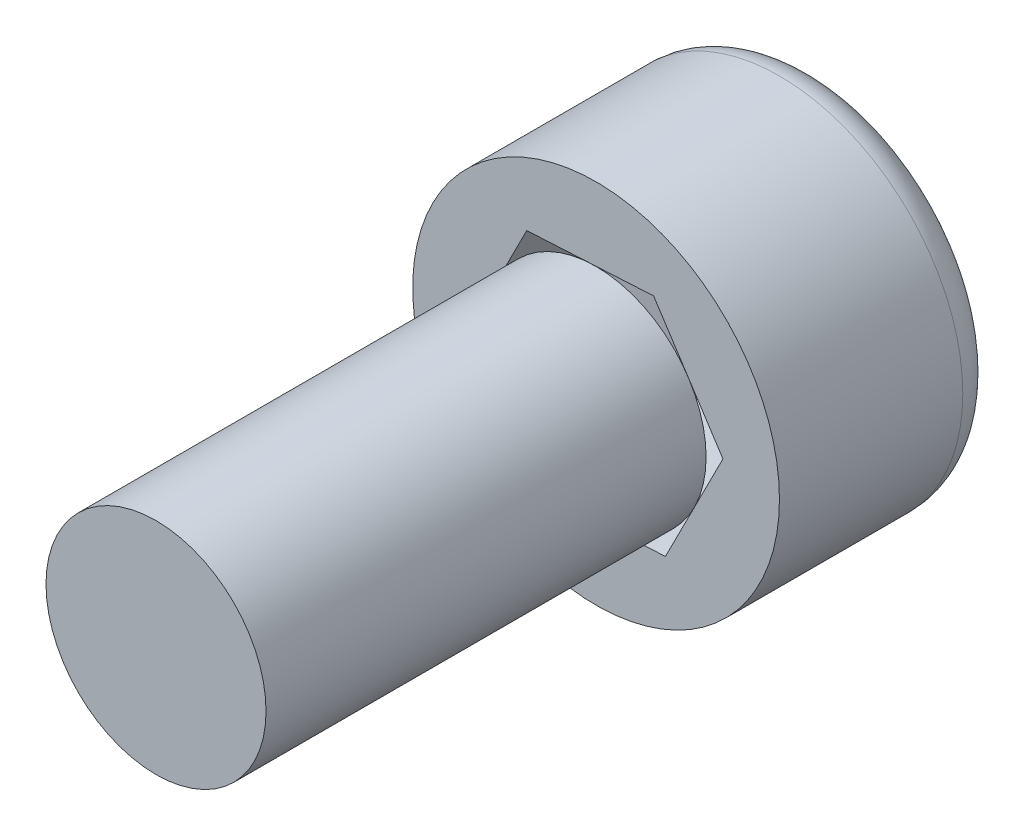
ISO-10303-21;
HEADER;
FILE_DESCRIPTION(('STEP AP214'),'2;1');
FILE_NAME('part.step','',(''),(''),'','','');
FILE_SCHEMA(('AUTOMOTIVE_DESIGN { 1 0 10303 214 1 1 1 1 }'));
ENDSEC;
DATA;
#1=APPLICATION_CONTEXT('core data for automotive mechanical design processes');
#2=APPLICATION_PROTOCOL_DEFINITION('international standard','automotive_design',2000,#1);
#3=PRODUCT_CONTEXT('',#1,'mechanical');
#4=PRODUCT('Part','Part','',(#3));
#5=PRODUCT_RELATED_PRODUCT_CATEGORY('part','',(#4));
#6=PRODUCT_DEFINITION_FORMATION('','',#4);
#7=PRODUCT_DEFINITION_CONTEXT('part definition',#1,'design');
#8=PRODUCT_DEFINITION('design','',#6,#7);
#9=PRODUCT_DEFINITION_SHAPE('','',#8);
#10=(LENGTH_UNIT() NAMED_UNIT(*) SI_UNIT(.MILLI.,.METRE.));
#11=(NAMED_UNIT(*) PLANE_ANGLE_UNIT() SI_UNIT($,.RADIAN.));
#12=(NAMED_UNIT(*) SI_UNIT($,.STERADIAN.) SOLID_ANGLE_UNIT());
#13=UNCERTAINTY_MEASURE_WITH_UNIT(LENGTH_MEASURE(1.E-05),#10,'distance_accuracy_value','');
#14=(GEOMETRIC_REPRESENTATION_CONTEXT(3) GLOBAL_UNCERTAINTY_ASSIGNED_CONTEXT((#13)) GLOBAL_UNIT_ASSIGNED_CONTEXT((#10,
#11,#12)) REPRESENTATION_CONTEXT('',''));
#15=CARTESIAN_POINT('',(0.,0.,0.));
#16=DIRECTION('',(0.,0.,1.));
#17=DIRECTION('',(1.,0.,0.));
#18=AXIS2_PLACEMENT_3D('',#15,#16,#17);
#19=CARTESIAN_POINT('',(0.,0.,3.));
#20=DIRECTION('',(0.,0.,-1.));
#21=DIRECTION('',(-1.,0.,0.));
#22=AXIS2_PLACEMENT_3D('',#19,#20,#21);
#23=CYLINDRICAL_SURFACE('',#22,2.5);
#24=CARTESIAN_POINT('',(0.,0.,0.5));
#25=DIRECTION('',(0.,0.,1.));
#26=DIRECTION('',(1.,0.,0.));
#27=AXIS2_PLACEMENT_3D('',#24,#25,#26);
#28=CIRCLE('',#27,2.5);
#29=CARTESIAN_POINT('',(2.5,0.,0.5));
#30=VERTEX_POINT('',#29);
#31=EDGE_CURVE('E49',#30,#30,#28,.T.);
#32=ORIENTED_EDGE('',*,*,#31,.T.);
#33=EDGE_LOOP('',(#32));
#34=FACE_BOUND('',#33,.T.);
#35=CARTESIAN_POINT('',(0.,0.,3.));
#36=DIRECTION('',(0.,0.,1.));
#37=DIRECTION('',(1.,0.,0.));
#38=AXIS2_PLACEMENT_3D('',#35,#36,#37);
#39=CIRCLE('',#38,2.5);
#40=CARTESIAN_POINT('',(2.5,0.,3.));
#41=VERTEX_POINT('',#40);
#42=EDGE_CURVE('E164',#41,#41,#39,.T.);
#43=ORIENTED_EDGE('',*,*,#42,.F.);
#44=EDGE_LOOP('',(#43));
#45=FACE_BOUND('',#44,.T.);
#46=ADVANCED_FACE('F40',(#34,#45),#23,.T.);
#47=CARTESIAN_POINT('',(0.,0.,3.));
#48=DIRECTION('',(0.,0.,1.));
#49=DIRECTION('',(1.,0.,0.));
#50=AXIS2_PLACEMENT_3D('',#47,#48,#49);
#51=PLANE('',#50);
#52=DIRECTION('',(-0.998565318577122,-0.0535472178079434,0.));
#53=VECTOR('',#52,1.);
#54=CARTESIAN_POINT('',(0.945103759937804,-1.45147472694203,3.));
#55=LINE('',#54,#53);
#56=CARTESIAN_POINT('',(0.945103759937804,-1.45147472694203,3.));
#57=VERTEX_POINT('',#56);
#58=CARTESIAN_POINT('',(-0.784462106513973,-1.54422122878934,3.));
#59=VERTEX_POINT('',#58);
#60=EDGE_CURVE('E93',#57,#59,#55,.T.);
#61=ORIENTED_EDGE('',*,*,#60,.T.);
#62=DIRECTION('',(-0.545655910212218,0.838009324321917,0.));
#63=VECTOR('',#62,1.);
#64=CARTESIAN_POINT('',(-0.784462106513973,-1.54422122878934,3.));
#65=LINE('',#64,#63);
#66=CARTESIAN_POINT('',(-1.72956586645178,-0.0927465018473138,3.));
#67=VERTEX_POINT('',#66);
#68=EDGE_CURVE('E56',#59,#67,#65,.T.);
#69=ORIENTED_EDGE('',*,*,#68,.T.);
#70=DIRECTION('',(0.452909408364904,0.89155654212986,0.));
#71=VECTOR('',#70,1.);
#72=CARTESIAN_POINT('',(-1.72956586645178,-0.0927465018473138,3.));
#73=LINE('',#72,#71);
#74=CARTESIAN_POINT('',(-0.945103759937803,1.45147472694203,3.));
#75=VERTEX_POINT('',#74);
#76=EDGE_CURVE('E103',#67,#75,#73,.T.);
#77=ORIENTED_EDGE('',*,*,#76,.T.);
#78=DIRECTION('',(0.998565318577122,0.0535472178079431,0.));
#79=VECTOR('',#78,1.);
#80=CARTESIAN_POINT('',(-0.945103759937803,1.45147472694203,3.));
#81=LINE('',#80,#79);
#82=CARTESIAN_POINT('',(0.784462106513974,1.54422122878934,3.));
#83=VERTEX_POINT('',#82);
#84=EDGE_CURVE('E175',#75,#83,#81,.T.);
#85=ORIENTED_EDGE('',*,*,#84,.T.);
#86=DIRECTION('',(0.545655910212218,-0.838009324321917,0.));
#87=VECTOR('',#86,1.);
#88=CARTESIAN_POINT('',(0.784462106513974,1.54422122878934,3.));
#89=LINE('',#88,#87);
#90=CARTESIAN_POINT('',(1.72956586645178,0.0927465018473145,3.));
#91=VERTEX_POINT('',#90);
#92=EDGE_CURVE('E173',#83,#91,#89,.T.);
#93=ORIENTED_EDGE('',*,*,#92,.T.);
#94=DIRECTION('',(-0.452909408364904,-0.89155654212986,0.));
#95=VECTOR('',#94,1.);
#96=CARTESIAN_POINT('',(1.72956586645178,0.0927465018473145,3.));
#97=LINE('',#96,#95);
#98=EDGE_CURVE('E108',#91,#57,#97,.T.);
#99=ORIENTED_EDGE('',*,*,#98,.T.);
#100=EDGE_LOOP('',(#61,#69,#77,#85,#93,#99));
#101=FACE_BOUND('',#100,.T.);
#102=ORIENTED_EDGE('',*,*,#42,.T.);
#103=EDGE_LOOP('',(#102));
#104=FACE_BOUND('',#103,.T.);
#105=ADVANCED_FACE('F105',(#101,#104),#51,.T.);
#106=CARTESIAN_POINT('',(0.,0.,0.));
#107=DIRECTION('',(0.,0.,1.));
#108=DIRECTION('',(1.,0.,0.));
#109=AXIS2_PLACEMENT_3D('',#106,#107,#108);
#110=PLANE('',#109);
#111=CARTESIAN_POINT('',(0.,0.,0.));
#112=DIRECTION('',(0.,0.,1.));
#113=DIRECTION('',(1.,0.,0.));
#114=AXIS2_PLACEMENT_3D('',#111,#112,#113);
#115=CIRCLE('',#114,2.);
#116=CARTESIAN_POINT('',(2.,0.,0.));
#117=VERTEX_POINT('',#116);
#118=EDGE_CURVE('E12',#117,#117,#115,.F.);
#119=ORIENTED_EDGE('',*,*,#118,.T.);
#120=EDGE_LOOP('',(#119));
#121=FACE_BOUND('',#120,.T.);
#122=DIRECTION('',(-0.545655910212218,0.838009324321917,0.));
#123=VECTOR('',#122,1.);
#124=CARTESIAN_POINT('',(-0.784462106513973,-1.54422122878934,0.));
#125=LINE('',#124,#123);
#126=CARTESIAN_POINT('',(-0.784462106513973,-1.54422122878934,0.));
#127=VERTEX_POINT('',#126);
#128=CARTESIAN_POINT('',(-1.72956586645178,-0.0927465018473138,0.));
#129=VERTEX_POINT('',#128);
#130=EDGE_CURVE('E98',#127,#129,#125,.T.);
#131=ORIENTED_EDGE('',*,*,#130,.F.);
#132=DIRECTION('',(-0.998565318577122,-0.0535472178079434,0.));
#133=VECTOR('',#132,1.);
#134=CARTESIAN_POINT('',(0.945103759937804,-1.45147472694203,0.));
#135=LINE('',#134,#133);
#136=CARTESIAN_POINT('',(0.945103759937804,-1.45147472694203,0.));
#137=VERTEX_POINT('',#136);
#138=EDGE_CURVE('E89',#137,#127,#135,.T.);
#139=ORIENTED_EDGE('',*,*,#138,.F.);
#140=DIRECTION('',(-0.452909408364904,-0.89155654212986,0.));
#141=VECTOR('',#140,1.);
#142=CARTESIAN_POINT('',(1.72956586645178,0.0927465018473145,0.));
#143=LINE('',#142,#141);
#144=CARTESIAN_POINT('',(1.72956586645178,0.0927465018473145,0.));
#145=VERTEX_POINT('',#144);
#146=EDGE_CURVE('E155',#145,#137,#143,.T.);
#147=ORIENTED_EDGE('',*,*,#146,.F.);
#148=DIRECTION('',(0.545655910212218,-0.838009324321917,0.));
#149=VECTOR('',#148,1.);
#150=CARTESIAN_POINT('',(0.784462106513974,1.54422122878934,0.));
#151=LINE('',#150,#149);
#152=CARTESIAN_POINT('',(0.784462106513974,1.54422122878934,0.));
#153=VERTEX_POINT('',#152);
#154=EDGE_CURVE('E188',#153,#145,#151,.T.);
#155=ORIENTED_EDGE('',*,*,#154,.F.);
#156=DIRECTION('',(0.998565318577122,0.0535472178079431,0.));
#157=VECTOR('',#156,1.);
#158=CARTESIAN_POINT('',(-0.945103759937803,1.45147472694203,0.));
#159=LINE('',#158,#157);
#160=CARTESIAN_POINT('',(-0.945103759937803,1.45147472694203,0.));
#161=VERTEX_POINT('',#160);
#162=EDGE_CURVE('E184',#161,#153,#159,.T.);
#163=ORIENTED_EDGE('',*,*,#162,.F.);
#164=DIRECTION('',(0.452909408364904,0.89155654212986,0.));
#165=VECTOR('',#164,1.);
#166=CARTESIAN_POINT('',(-1.72956586645178,-0.0927465018473138,0.));
#167=LINE('',#166,#165);
#168=EDGE_CURVE('E181',#129,#161,#167,.T.);
#169=ORIENTED_EDGE('',*,*,#168,.F.);
#170=EDGE_LOOP('',(#131,#139,#147,#155,#163,#169));
#171=FACE_BOUND('',#170,.T.);
#172=ADVANCED_FACE('F130',(#121,#171),#110,.F.);
#173=CARTESIAN_POINT('',(0.945103759937804,-1.45147472694203,3.));
#174=DIRECTION('',(0.0535472178079434,-0.998565318577122,0.));
#175=DIRECTION('',(0.998565318577122,0.0535472178079434,0.));
#176=AXIS2_PLACEMENT_3D('',#173,#174,#175);
#177=PLANE('',#176);
#178=ORIENTED_EDGE('',*,*,#138,.T.);
#179=DIRECTION('',(0.,0.,-1.));
#180=VECTOR('',#179,1.);
#181=CARTESIAN_POINT('',(-0.784462106513973,-1.54422122878934,3.));
#182=LINE('',#181,#180);
#183=EDGE_CURVE('E91',#59,#127,#182,.T.);
#184=ORIENTED_EDGE('',*,*,#183,.F.);
#185=ORIENTED_EDGE('',*,*,#60,.F.);
#186=DIRECTION('',(0.,0.,-1.));
#187=VECTOR('',#186,1.);
#188=CARTESIAN_POINT('',(0.945103759937804,-1.45147472694203,3.));
#189=LINE('',#188,#187);
#190=EDGE_CURVE('E156',#57,#137,#189,.T.);
#191=ORIENTED_EDGE('',*,*,#190,.T.);
#192=EDGE_LOOP('',(#178,#184,#185,#191));
#193=FACE_BOUND('',#192,.T.);
#194=ADVANCED_FACE('F92',(#193),#177,.F.);
#195=CARTESIAN_POINT('',(1.72956586645178,0.0927465018473145,3.));
#196=DIRECTION('',(0.89155654212986,-0.452909408364904,0.));
#197=DIRECTION('',(0.452909408364904,0.89155654212986,0.));
#198=AXIS2_PLACEMENT_3D('',#195,#196,#197);
#199=PLANE('',#198);
#200=ORIENTED_EDGE('',*,*,#146,.T.);
#201=ORIENTED_EDGE('',*,*,#190,.F.);
#202=ORIENTED_EDGE('',*,*,#98,.F.);
#203=DIRECTION('',(0.,0.,-1.));
#204=VECTOR('',#203,1.);
#205=CARTESIAN_POINT('',(1.72956586645178,0.0927465018473145,3.));
#206=LINE('',#205,#204);
#207=EDGE_CURVE('E158',#91,#145,#206,.T.);
#208=ORIENTED_EDGE('',*,*,#207,.T.);
#209=EDGE_LOOP('',(#200,#201,#202,#208));
#210=FACE_BOUND('',#209,.T.);
#211=ADVANCED_FACE('F137',(#210),#199,.F.);
#212=CARTESIAN_POINT('',(0.784462106513974,1.54422122878934,3.));
#213=DIRECTION('',(0.838009324321917,0.545655910212218,0.));
#214=DIRECTION('',(-0.545655910212218,0.838009324321917,0.));
#215=AXIS2_PLACEMENT_3D('',#212,#213,#214);
#216=PLANE('',#215);
#217=ORIENTED_EDGE('',*,*,#154,.T.);
#218=ORIENTED_EDGE('',*,*,#207,.F.);
#219=ORIENTED_EDGE('',*,*,#92,.F.);
#220=DIRECTION('',(0.,0.,-1.));
#221=VECTOR('',#220,1.);
#222=CARTESIAN_POINT('',(0.784462106513974,1.54422122878934,3.));
#223=LINE('',#222,#221);
#224=EDGE_CURVE('E186',#83,#153,#223,.T.);
#225=ORIENTED_EDGE('',*,*,#224,.T.);
#226=EDGE_LOOP('',(#217,#218,#219,#225));
#227=FACE_BOUND('',#226,.T.);
#228=ADVANCED_FACE('F145',(#227),#216,.F.);
#229=CARTESIAN_POINT('',(-0.945103759937803,1.45147472694203,3.));
#230=DIRECTION('',(-0.0535472178079431,0.998565318577122,0.));
#231=DIRECTION('',(-0.998565318577122,-0.0535472178079432,0.));
#232=AXIS2_PLACEMENT_3D('',#229,#230,#231);
#233=PLANE('',#232);
#234=ORIENTED_EDGE('',*,*,#162,.T.);
#235=ORIENTED_EDGE('',*,*,#224,.F.);
#236=ORIENTED_EDGE('',*,*,#84,.F.);
#237=DIRECTION('',(0.,0.,-1.));
#238=VECTOR('',#237,1.);
#239=CARTESIAN_POINT('',(-0.945103759937803,1.45147472694203,3.));
#240=LINE('',#239,#238);
#241=EDGE_CURVE('E180',#75,#161,#240,.T.);
#242=ORIENTED_EDGE('',*,*,#241,.T.);
#243=EDGE_LOOP('',(#234,#235,#236,#242));
#244=FACE_BOUND('',#243,.T.);
#245=ADVANCED_FACE('F141',(#244),#233,.F.);
#246=CARTESIAN_POINT('',(-1.72956586645178,-0.0927465018473138,3.));
#247=DIRECTION('',(-0.89155654212986,0.452909408364904,0.));
#248=DIRECTION('',(-0.452909408364904,-0.89155654212986,0.));
#249=AXIS2_PLACEMENT_3D('',#246,#247,#248);
#250=PLANE('',#249);
#251=ORIENTED_EDGE('',*,*,#168,.T.);
#252=ORIENTED_EDGE('',*,*,#241,.F.);
#253=ORIENTED_EDGE('',*,*,#76,.F.);
#254=DIRECTION('',(0.,0.,-1.));
#255=VECTOR('',#254,1.);
#256=CARTESIAN_POINT('',(-1.72956586645178,-0.0927465018473138,3.));
#257=LINE('',#256,#255);
#258=EDGE_CURVE('E101',#67,#129,#257,.T.);
#259=ORIENTED_EDGE('',*,*,#258,.T.);
#260=EDGE_LOOP('',(#251,#252,#253,#259));
#261=FACE_BOUND('',#260,.T.);
#262=ADVANCED_FACE('F122',(#261),#250,.F.);
#263=CARTESIAN_POINT('',(-0.784462106513973,-1.54422122878934,3.));
#264=DIRECTION('',(-0.838009324321917,-0.545655910212218,0.));
#265=DIRECTION('',(0.545655910212218,-0.838009324321917,0.));
#266=AXIS2_PLACEMENT_3D('',#263,#264,#265);
#267=PLANE('',#266);
#268=ORIENTED_EDGE('',*,*,#130,.T.);
#269=ORIENTED_EDGE('',*,*,#258,.F.);
#270=ORIENTED_EDGE('',*,*,#68,.F.);
#271=ORIENTED_EDGE('',*,*,#183,.T.);
#272=EDGE_LOOP('',(#268,#269,#270,#271));
#273=FACE_BOUND('',#272,.T.);
#274=ADVANCED_FACE('F100',(#273),#267,.F.);
#275=CARTESIAN_POINT('',(0.,0.,0.5));
#276=DIRECTION('',(0.,0.,1.));
#277=DIRECTION('',(1.,0.,0.));
#278=AXIS2_PLACEMENT_3D('',#275,#276,#277);
#279=TOROIDAL_SURFACE('',#278,2.,0.5);
#280=ORIENTED_EDGE('',*,*,#118,.F.);
#281=EDGE_LOOP('',(#280));
#282=FACE_BOUND('',#281,.T.);
#283=ORIENTED_EDGE('',*,*,#31,.F.);
#284=EDGE_LOOP('',(#283));
#285=FACE_BOUND('',#284,.T.);
#286=ADVANCED_FACE('F42',(#282,#285),#279,.T.);
#287=CLOSED_SHELL('',(#46,#105,#172,#194,#211,#228,#245,#262,#274,#286));
#288=MANIFOLD_SOLID_BREP('B2',#287);
#289=CARTESIAN_POINT('',(0.,0.,9.));
#290=DIRECTION('',(0.,0.,1.));
#291=DIRECTION('',(1.,0.,0.));
#292=AXIS2_PLACEMENT_3D('',#289,#290,#291);
#293=PLANE('',#292);
#294=CARTESIAN_POINT('',(0.,0.,9.));
#295=DIRECTION('',(0.,0.,1.));
#296=DIRECTION('',(1.,0.,0.));
#297=AXIS2_PLACEMENT_3D('',#294,#295,#296);
#298=CIRCLE('',#297,1.5);
#299=CARTESIAN_POINT('',(1.5,0.,9.));
#300=VERTEX_POINT('',#299);
#301=EDGE_CURVE('E258',#300,#300,#298,.T.);
#302=ORIENTED_EDGE('',*,*,#301,.T.);
#303=EDGE_LOOP('',(#302));
#304=FACE_BOUND('',#303,.T.);
#305=ADVANCED_FACE('F251',(#304),#293,.T.);
#306=CARTESIAN_POINT('',(0.,0.,9.));
#307=DIRECTION('',(0.,0.,-1.));
#308=DIRECTION('',(-1.,0.,0.));
#309=AXIS2_PLACEMENT_3D('',#306,#307,#308);
#310=CYLINDRICAL_SURFACE('',#309,1.5);
#311=ORIENTED_EDGE('',*,*,#301,.F.);
#312=EDGE_LOOP('',(#311));
#313=FACE_BOUND('',#312,.T.);
#314=CARTESIAN_POINT('',(0.,0.,3.));
#315=DIRECTION('',(0.,0.,1.));
#316=DIRECTION('',(1.,0.,0.));
#317=AXIS2_PLACEMENT_3D('',#314,#315,#316);
#318=CIRCLE('',#317,1.5);
#319=CARTESIAN_POINT('',(1.5,0.,3.));
#320=VERTEX_POINT('',#319);
#321=EDGE_CURVE('E39',#320,#320,#318,.T.);
#322=ORIENTED_EDGE('',*,*,#321,.T.);
#323=EDGE_LOOP('',(#322));
#324=FACE_BOUND('',#323,.T.);
#325=ADVANCED_FACE('F253',(#313,#324),#310,.T.);
#326=CARTESIAN_POINT('',(0.,0.,3.));
#327=DIRECTION('',(0.,0.,-1.));
#328=DIRECTION('',(-1.,0.,0.));
#329=AXIS2_PLACEMENT_3D('',#326,#327,#328);
#330=PLANE('',#329);
#331=ORIENTED_EDGE('',*,*,#321,.F.);
#332=EDGE_LOOP('',(#331));
#333=FACE_BOUND('',#332,.T.);
#334=ADVANCED_FACE('F266',(#333),#330,.T.);
#335=CLOSED_SHELL('',(#305,#325,#334));
#336=MANIFOLD_SOLID_BREP('B6',#335);
#337=ADVANCED_BREP_SHAPE_REPRESENTATION('',(#18,#288,#336),#14);
#338=SHAPE_DEFINITION_REPRESENTATION(#9,#337);
ENDSEC;
END-ISO-10303-21;
